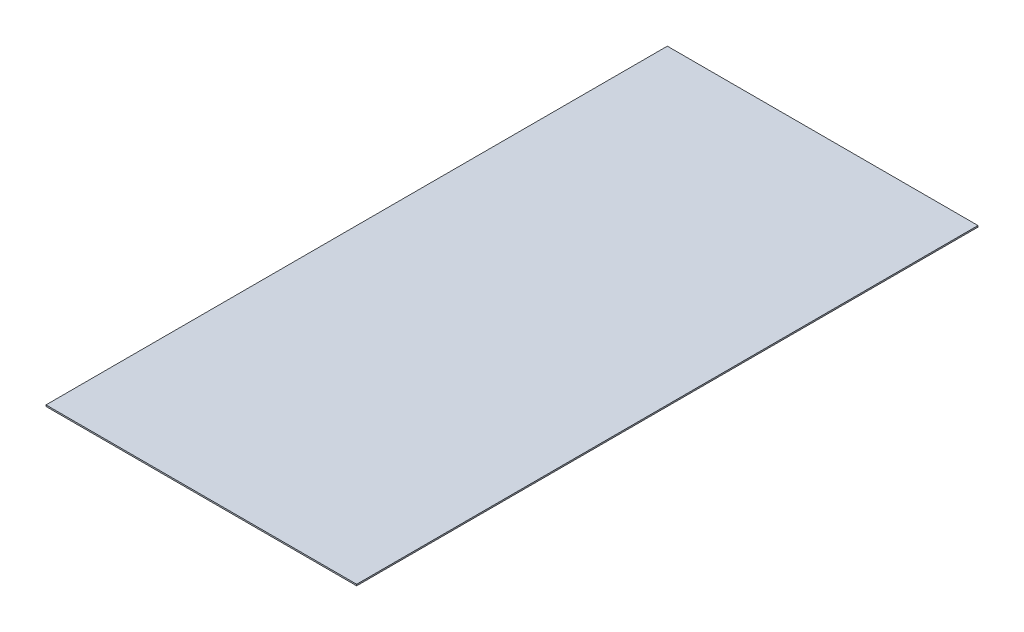
ISO-10303-21;
HEADER;
FILE_DESCRIPTION(('STEP AP214'),'2;1');
FILE_NAME('part.step','',(''),(''),'','','');
FILE_SCHEMA(('AUTOMOTIVE_DESIGN { 1 0 10303 214 1 1 1 1 }'));
ENDSEC;
DATA;
#1=APPLICATION_CONTEXT('core data for automotive mechanical design processes');
#2=APPLICATION_PROTOCOL_DEFINITION('international standard','automotive_design',2000,#1);
#3=PRODUCT_CONTEXT('',#1,'mechanical');
#4=PRODUCT('Part','Part','',(#3));
#5=PRODUCT_RELATED_PRODUCT_CATEGORY('part','',(#4));
#6=PRODUCT_DEFINITION_FORMATION('','',#4);
#7=PRODUCT_DEFINITION_CONTEXT('part definition',#1,'design');
#8=PRODUCT_DEFINITION('design','',#6,#7);
#9=PRODUCT_DEFINITION_SHAPE('','',#8);
#10=(LENGTH_UNIT() NAMED_UNIT(*) SI_UNIT(.MILLI.,.METRE.));
#11=(NAMED_UNIT(*) PLANE_ANGLE_UNIT() SI_UNIT($,.RADIAN.));
#12=(NAMED_UNIT(*) SI_UNIT($,.STERADIAN.) SOLID_ANGLE_UNIT());
#13=UNCERTAINTY_MEASURE_WITH_UNIT(LENGTH_MEASURE(1.E-05),#10,'distance_accuracy_value','');
#14=(GEOMETRIC_REPRESENTATION_CONTEXT(3) GLOBAL_UNCERTAINTY_ASSIGNED_CONTEXT((#13)) GLOBAL_UNIT_ASSIGNED_CONTEXT((#10,
#11,#12)) REPRESENTATION_CONTEXT('',''));
#15=CARTESIAN_POINT('',(0.,0.,0.));
#16=DIRECTION('',(0.,0.,1.));
#17=DIRECTION('',(1.,0.,0.));
#18=AXIS2_PLACEMENT_3D('',#15,#16,#17);
#19=CARTESIAN_POINT('',(609.6,5.55625,1219.2));
#20=DIRECTION('',(-1.,0.,0.));
#21=DIRECTION('',(0.,0.,1.));
#22=AXIS2_PLACEMENT_3D('',#19,#20,#21);
#23=PLANE('',#22);
#24=DIRECTION('',(0.,0.,-1.));
#25=VECTOR('',#24,1.);
#26=CARTESIAN_POINT('',(609.6,0.,1219.2));
#27=LINE('',#26,#25);
#28=CARTESIAN_POINT('',(609.6,0.,1219.2));
#29=VERTEX_POINT('',#28);
#30=CARTESIAN_POINT('',(609.6,0.,-1219.2));
#31=VERTEX_POINT('',#30);
#32=EDGE_CURVE('E102',#29,#31,#27,.T.);
#33=ORIENTED_EDGE('',*,*,#32,.T.);
#34=DIRECTION('',(0.,-1.,0.));
#35=VECTOR('',#34,1.);
#36=CARTESIAN_POINT('',(609.6,5.55625,-1219.2));
#37=LINE('',#36,#35);
#38=CARTESIAN_POINT('',(609.6,5.55625,-1219.2));
#39=VERTEX_POINT('',#38);
#40=EDGE_CURVE('E11',#39,#31,#37,.T.);
#41=ORIENTED_EDGE('',*,*,#40,.F.);
#42=DIRECTION('',(0.,0.,-1.));
#43=VECTOR('',#42,1.);
#44=CARTESIAN_POINT('',(609.6,5.55625,1219.2));
#45=LINE('',#44,#43);
#46=CARTESIAN_POINT('',(609.6,5.55625,1219.2));
#47=VERTEX_POINT('',#46);
#48=EDGE_CURVE('E90',#47,#39,#45,.T.);
#49=ORIENTED_EDGE('',*,*,#48,.F.);
#50=DIRECTION('',(0.,-1.,0.));
#51=VECTOR('',#50,1.);
#52=CARTESIAN_POINT('',(609.6,5.55625,1219.2));
#53=LINE('',#52,#51);
#54=EDGE_CURVE('E98',#47,#29,#53,.T.);
#55=ORIENTED_EDGE('',*,*,#54,.T.);
#56=EDGE_LOOP('',(#33,#41,#49,#55));
#57=FACE_BOUND('',#56,.T.);
#58=ADVANCED_FACE('F39',(#57),#23,.F.);
#59=CARTESIAN_POINT('',(-609.6,5.55625,-1219.2));
#60=DIRECTION('',(0.,0.,1.));
#61=DIRECTION('',(1.,0.,0.));
#62=AXIS2_PLACEMENT_3D('',#59,#60,#61);
#63=PLANE('',#62);
#64=DIRECTION('',(-1.,0.,0.));
#65=VECTOR('',#64,1.);
#66=CARTESIAN_POINT('',(-609.6,0.,-1219.2));
#67=LINE('',#66,#65);
#68=CARTESIAN_POINT('',(-609.6,0.,-1219.2));
#69=VERTEX_POINT('',#68);
#70=EDGE_CURVE('E94',#31,#69,#67,.T.);
#71=ORIENTED_EDGE('',*,*,#70,.T.);
#72=DIRECTION('',(0.,-1.,0.));
#73=VECTOR('',#72,1.);
#74=CARTESIAN_POINT('',(-609.6,5.55625,-1219.2));
#75=LINE('',#74,#73);
#76=CARTESIAN_POINT('',(-609.6,5.55625,-1219.2));
#77=VERTEX_POINT('',#76);
#78=EDGE_CURVE('E47',#77,#69,#75,.T.);
#79=ORIENTED_EDGE('',*,*,#78,.F.);
#80=DIRECTION('',(-1.,0.,0.));
#81=VECTOR('',#80,1.);
#82=CARTESIAN_POINT('',(-609.6,5.55625,-1219.2));
#83=LINE('',#82,#81);
#84=EDGE_CURVE('E85',#39,#77,#83,.T.);
#85=ORIENTED_EDGE('',*,*,#84,.F.);
#86=ORIENTED_EDGE('',*,*,#40,.T.);
#87=EDGE_LOOP('',(#71,#79,#85,#86));
#88=FACE_BOUND('',#87,.T.);
#89=ADVANCED_FACE('F93',(#88),#63,.F.);
#90=CARTESIAN_POINT('',(-609.6,5.55625,1219.2));
#91=DIRECTION('',(1.,0.,0.));
#92=DIRECTION('',(0.,0.,-1.));
#93=AXIS2_PLACEMENT_3D('',#90,#91,#92);
#94=PLANE('',#93);
#95=DIRECTION('',(0.,0.,1.));
#96=VECTOR('',#95,1.);
#97=CARTESIAN_POINT('',(-609.6,0.,1219.2));
#98=LINE('',#97,#96);
#99=CARTESIAN_POINT('',(-609.6,0.,1219.2));
#100=VERTEX_POINT('',#99);
#101=EDGE_CURVE('E72',#69,#100,#98,.T.);
#102=ORIENTED_EDGE('',*,*,#101,.T.);
#103=DIRECTION('',(0.,-1.,0.));
#104=VECTOR('',#103,1.);
#105=CARTESIAN_POINT('',(-609.6,5.55625,1219.2));
#106=LINE('',#105,#104);
#107=CARTESIAN_POINT('',(-609.6,5.55625,1219.2));
#108=VERTEX_POINT('',#107);
#109=EDGE_CURVE('E95',#108,#100,#106,.T.);
#110=ORIENTED_EDGE('',*,*,#109,.F.);
#111=DIRECTION('',(0.,0.,1.));
#112=VECTOR('',#111,1.);
#113=CARTESIAN_POINT('',(-609.6,5.55625,1219.2));
#114=LINE('',#113,#112);
#115=EDGE_CURVE('E88',#77,#108,#114,.T.);
#116=ORIENTED_EDGE('',*,*,#115,.F.);
#117=ORIENTED_EDGE('',*,*,#78,.T.);
#118=EDGE_LOOP('',(#102,#110,#116,#117));
#119=FACE_BOUND('',#118,.T.);
#120=ADVANCED_FACE('F96',(#119),#94,.F.);
#121=CARTESIAN_POINT('',(-609.6,5.55625,1219.2));
#122=DIRECTION('',(0.,0.,-1.));
#123=DIRECTION('',(-1.,0.,0.));
#124=AXIS2_PLACEMENT_3D('',#121,#122,#123);
#125=PLANE('',#124);
#126=DIRECTION('',(1.,0.,0.));
#127=VECTOR('',#126,1.);
#128=CARTESIAN_POINT('',(-609.6,0.,1219.2));
#129=LINE('',#128,#127);
#130=EDGE_CURVE('E78',#100,#29,#129,.T.);
#131=ORIENTED_EDGE('',*,*,#130,.T.);
#132=ORIENTED_EDGE('',*,*,#54,.F.);
#133=DIRECTION('',(1.,0.,0.));
#134=VECTOR('',#133,1.);
#135=CARTESIAN_POINT('',(-609.6,5.55625,1219.2));
#136=LINE('',#135,#134);
#137=EDGE_CURVE('E55',#108,#47,#136,.T.);
#138=ORIENTED_EDGE('',*,*,#137,.F.);
#139=ORIENTED_EDGE('',*,*,#109,.T.);
#140=EDGE_LOOP('',(#131,#132,#138,#139));
#141=FACE_BOUND('',#140,.T.);
#142=ADVANCED_FACE('F109',(#141),#125,.F.);
#143=CARTESIAN_POINT('',(0.,5.55625,0.));
#144=DIRECTION('',(0.,-1.,0.));
#145=DIRECTION('',(0.,0.,-1.));
#146=AXIS2_PLACEMENT_3D('',#143,#144,#145);
#147=PLANE('',#146);
#148=ORIENTED_EDGE('',*,*,#48,.T.);
#149=ORIENTED_EDGE('',*,*,#84,.T.);
#150=ORIENTED_EDGE('',*,*,#115,.T.);
#151=ORIENTED_EDGE('',*,*,#137,.T.);
#152=EDGE_LOOP('',(#148,#149,#150,#151));
#153=FACE_BOUND('',#152,.T.);
#154=ADVANCED_FACE('F86',(#153),#147,.F.);
#155=CARTESIAN_POINT('',(0.,0.,0.));
#156=DIRECTION('',(0.,-1.,0.));
#157=DIRECTION('',(0.,0.,-1.));
#158=AXIS2_PLACEMENT_3D('',#155,#156,#157);
#159=PLANE('',#158);
#160=ORIENTED_EDGE('',*,*,#32,.F.);
#161=ORIENTED_EDGE('',*,*,#130,.F.);
#162=ORIENTED_EDGE('',*,*,#101,.F.);
#163=ORIENTED_EDGE('',*,*,#70,.F.);
#164=EDGE_LOOP('',(#160,#161,#162,#163));
#165=FACE_BOUND('',#164,.T.);
#166=ADVANCED_FACE('F112',(#165),#159,.T.);
#167=CLOSED_SHELL('',(#58,#89,#120,#142,#154,#166));
#168=MANIFOLD_SOLID_BREP('B2',#167);
#169=ADVANCED_BREP_SHAPE_REPRESENTATION('',(#18,#168),#14);
#170=SHAPE_DEFINITION_REPRESENTATION(#9,#169);
ENDSEC;
END-ISO-10303-21;
